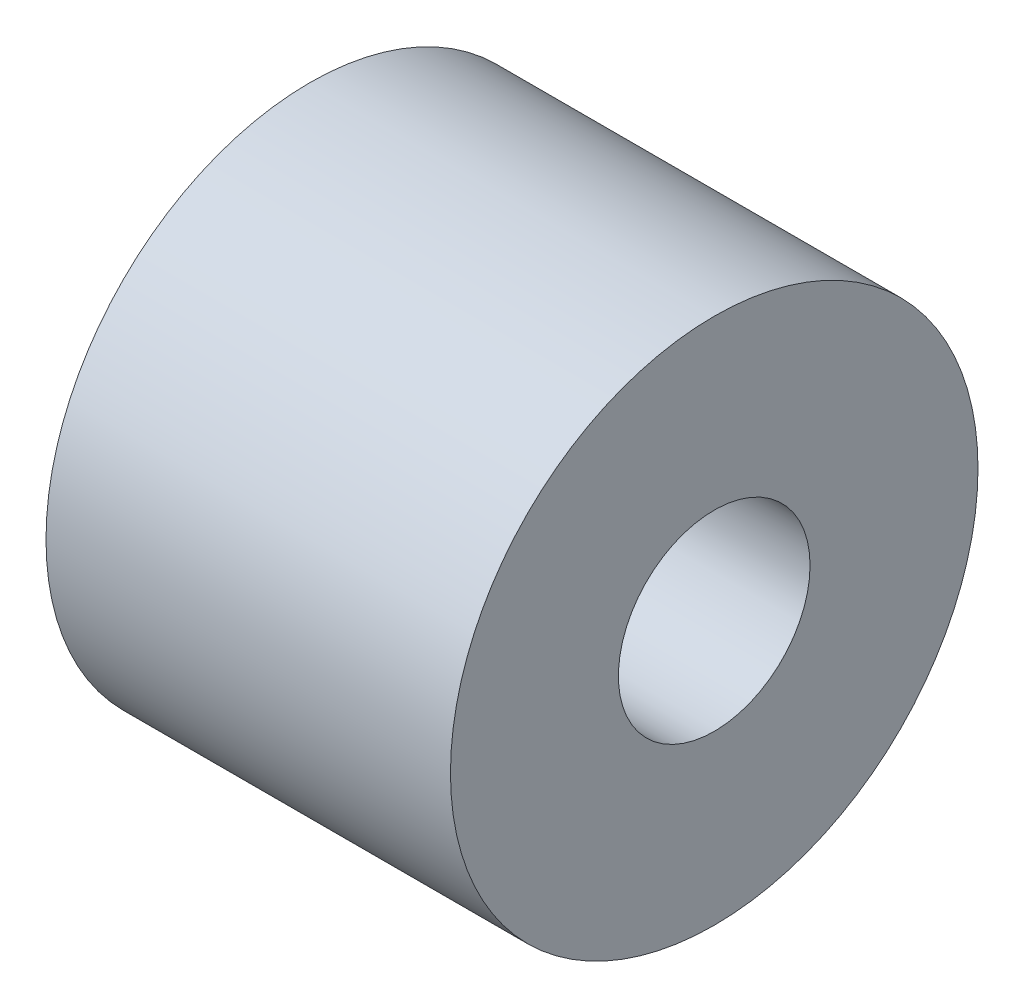
ISO-10303-21;
HEADER;
FILE_DESCRIPTION(('STEP AP214'),'2;1');
FILE_NAME('part.step','',(''),(''),'','','');
FILE_SCHEMA(('AUTOMOTIVE_DESIGN { 1 0 10303 214 1 1 1 1 }'));
ENDSEC;
DATA;
#1=APPLICATION_CONTEXT('core data for automotive mechanical design processes');
#2=APPLICATION_PROTOCOL_DEFINITION('international standard','automotive_design',2000,#1);
#3=PRODUCT_CONTEXT('',#1,'mechanical');
#4=PRODUCT('Part','Part','',(#3));
#5=PRODUCT_RELATED_PRODUCT_CATEGORY('part','',(#4));
#6=PRODUCT_DEFINITION_FORMATION('','',#4);
#7=PRODUCT_DEFINITION_CONTEXT('part definition',#1,'design');
#8=PRODUCT_DEFINITION('design','',#6,#7);
#9=PRODUCT_DEFINITION_SHAPE('','',#8);
#10=(LENGTH_UNIT() NAMED_UNIT(*) SI_UNIT(.MILLI.,.METRE.));
#11=(NAMED_UNIT(*) PLANE_ANGLE_UNIT() SI_UNIT($,.RADIAN.));
#12=(NAMED_UNIT(*) SI_UNIT($,.STERADIAN.) SOLID_ANGLE_UNIT());
#13=UNCERTAINTY_MEASURE_WITH_UNIT(LENGTH_MEASURE(1.E-05),#10,'distance_accuracy_value','');
#14=(GEOMETRIC_REPRESENTATION_CONTEXT(3) GLOBAL_UNCERTAINTY_ASSIGNED_CONTEXT((#13)) GLOBAL_UNIT_ASSIGNED_CONTEXT((#10,
#11,#12)) REPRESENTATION_CONTEXT('',''));
#15=CARTESIAN_POINT('',(0.,0.,0.));
#16=DIRECTION('',(0.,0.,1.));
#17=DIRECTION('',(1.,0.,0.));
#18=AXIS2_PLACEMENT_3D('',#15,#16,#17);
#19=CARTESIAN_POINT('',(46.,0.,0.));
#20=DIRECTION('',(-1.,0.,0.));
#21=DIRECTION('',(0.,0.,1.));
#22=AXIS2_PLACEMENT_3D('',#19,#20,#21);
#23=CYLINDRICAL_SURFACE('',#22,9.);
#24=CARTESIAN_POINT('',(0.,0.,0.));
#25=DIRECTION('',(1.,0.,0.));
#26=DIRECTION('',(0.,0.,-1.));
#27=AXIS2_PLACEMENT_3D('',#24,#25,#26);
#28=CIRCLE('',#27,9.);
#29=CARTESIAN_POINT('',(0.,0.,-9.));
#30=VERTEX_POINT('',#29);
#31=EDGE_CURVE('E43',#30,#30,#28,.T.);
#32=ORIENTED_EDGE('',*,*,#31,.F.);
#33=EDGE_LOOP('',(#32));
#34=FACE_BOUND('',#33,.T.);
#35=CARTESIAN_POINT('',(23.,0.,0.));
#36=DIRECTION('',(1.,0.,0.));
#37=DIRECTION('',(0.,0.,-1.));
#38=AXIS2_PLACEMENT_3D('',#35,#36,#37);
#39=CIRCLE('',#38,9.);
#40=CARTESIAN_POINT('',(23.,0.,-9.));
#41=VERTEX_POINT('',#40);
#42=EDGE_CURVE('E34',#41,#41,#39,.T.);
#43=ORIENTED_EDGE('',*,*,#42,.T.);
#44=EDGE_LOOP('',(#43));
#45=FACE_BOUND('',#44,.T.);
#46=ADVANCED_FACE('F30',(#34,#45),#23,.F.);
#47=CARTESIAN_POINT('',(46.,0.,0.));
#48=DIRECTION('',(1.,0.,0.));
#49=DIRECTION('',(0.,0.,-1.));
#50=AXIS2_PLACEMENT_3D('',#47,#48,#49);
#51=PLANE('',#50);
#52=CARTESIAN_POINT('',(46.,0.,0.));
#53=DIRECTION('',(1.,0.,0.));
#54=DIRECTION('',(0.,0.,-1.));
#55=AXIS2_PLACEMENT_3D('',#52,#53,#54);
#56=CIRCLE('',#55,10.9);
#57=CARTESIAN_POINT('',(46.,0.,-10.9));
#58=VERTEX_POINT('',#57);
#59=EDGE_CURVE('E47',#58,#58,#56,.T.);
#60=ORIENTED_EDGE('',*,*,#59,.F.);
#61=EDGE_LOOP('',(#60));
#62=FACE_BOUND('',#61,.T.);
#63=CARTESIAN_POINT('',(46.,0.,0.));
#64=DIRECTION('',(1.,0.,0.));
#65=DIRECTION('',(0.,0.,-1.));
#66=AXIS2_PLACEMENT_3D('',#63,#64,#65);
#67=CIRCLE('',#66,30.);
#68=CARTESIAN_POINT('',(46.,0.,-30.));
#69=VERTEX_POINT('',#68);
#70=EDGE_CURVE('E10',#69,#69,#67,.T.);
#71=ORIENTED_EDGE('',*,*,#70,.T.);
#72=EDGE_LOOP('',(#71));
#73=FACE_BOUND('',#72,.T.);
#74=ADVANCED_FACE('F68',(#62,#73),#51,.T.);
#75=CARTESIAN_POINT('',(0.,0.,0.));
#76=DIRECTION('',(1.,0.,0.));
#77=DIRECTION('',(0.,0.,-1.));
#78=AXIS2_PLACEMENT_3D('',#75,#76,#77);
#79=PLANE('',#78);
#80=CARTESIAN_POINT('',(0.,0.,0.));
#81=DIRECTION('',(1.,0.,0.));
#82=DIRECTION('',(0.,0.,-1.));
#83=AXIS2_PLACEMENT_3D('',#80,#81,#82);
#84=CIRCLE('',#83,30.);
#85=CARTESIAN_POINT('',(0.,0.,-30.));
#86=VERTEX_POINT('',#85);
#87=EDGE_CURVE('E38',#86,#86,#84,.T.);
#88=ORIENTED_EDGE('',*,*,#87,.F.);
#89=EDGE_LOOP('',(#88));
#90=FACE_BOUND('',#89,.T.);
#91=ORIENTED_EDGE('',*,*,#31,.T.);
#92=EDGE_LOOP('',(#91));
#93=FACE_BOUND('',#92,.T.);
#94=ADVANCED_FACE('F74',(#90,#93),#79,.F.);
#95=CARTESIAN_POINT('',(46.,0.,0.));
#96=DIRECTION('',(-1.,0.,0.));
#97=DIRECTION('',(0.,0.,1.));
#98=AXIS2_PLACEMENT_3D('',#95,#96,#97);
#99=CYLINDRICAL_SURFACE('',#98,30.);
#100=ORIENTED_EDGE('',*,*,#70,.F.);
#101=EDGE_LOOP('',(#100));
#102=FACE_BOUND('',#101,.T.);
#103=ORIENTED_EDGE('',*,*,#87,.T.);
#104=EDGE_LOOP('',(#103));
#105=FACE_BOUND('',#104,.T.);
#106=ADVANCED_FACE('F32',(#102,#105),#99,.T.);
#107=CARTESIAN_POINT('',(23.,0.,0.));
#108=DIRECTION('',(1.,0.,0.));
#109=DIRECTION('',(0.,0.,-1.));
#110=AXIS2_PLACEMENT_3D('',#107,#108,#109);
#111=CYLINDRICAL_SURFACE('',#110,10.9);
#112=CARTESIAN_POINT('',(23.,0.,0.));
#113=DIRECTION('',(1.,0.,0.));
#114=DIRECTION('',(0.,0.,-1.));
#115=AXIS2_PLACEMENT_3D('',#112,#113,#114);
#116=CIRCLE('',#115,10.9);
#117=CARTESIAN_POINT('',(23.,0.,-10.9));
#118=VERTEX_POINT('',#117);
#119=EDGE_CURVE('E50',#118,#118,#116,.T.);
#120=ORIENTED_EDGE('',*,*,#119,.F.);
#121=EDGE_LOOP('',(#120));
#122=FACE_BOUND('',#121,.T.);
#123=ORIENTED_EDGE('',*,*,#59,.T.);
#124=EDGE_LOOP('',(#123));
#125=FACE_BOUND('',#124,.T.);
#126=ADVANCED_FACE('F60',(#122,#125),#111,.F.);
#127=CARTESIAN_POINT('',(23.,0.,0.));
#128=DIRECTION('',(1.,0.,0.));
#129=DIRECTION('',(0.,0.,-1.));
#130=AXIS2_PLACEMENT_3D('',#127,#128,#129);
#131=PLANE('',#130);
#132=ORIENTED_EDGE('',*,*,#42,.F.);
#133=EDGE_LOOP('',(#132));
#134=FACE_BOUND('',#133,.T.);
#135=ORIENTED_EDGE('',*,*,#119,.T.);
#136=EDGE_LOOP('',(#135));
#137=FACE_BOUND('',#136,.T.);
#138=ADVANCED_FACE('F58',(#134,#137),#131,.T.);
#139=CLOSED_SHELL('',(#46,#74,#94,#106,#126,#138));
#140=MANIFOLD_SOLID_BREP('B2',#139);
#141=ADVANCED_BREP_SHAPE_REPRESENTATION('',(#18,#140),#14);
#142=SHAPE_DEFINITION_REPRESENTATION(#9,#141);
ENDSEC;
END-ISO-10303-21;
